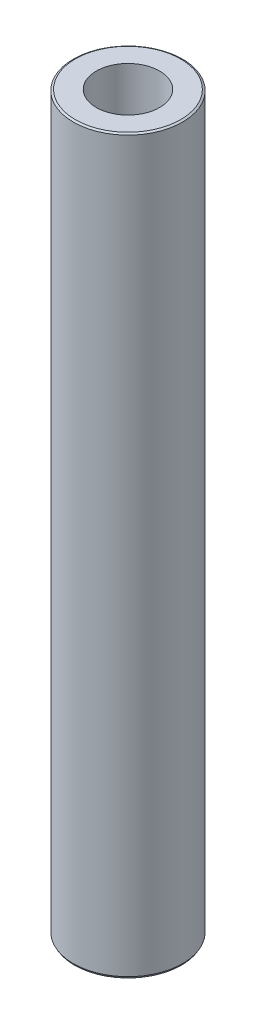
ISO-10303-21;
HEADER;
FILE_DESCRIPTION(('STEP AP214'),'2;1');
FILE_NAME('part.step','',(''),(''),'','','');
FILE_SCHEMA(('AUTOMOTIVE_DESIGN { 1 0 10303 214 1 1 1 1 }'));
ENDSEC;
DATA;
#1=APPLICATION_CONTEXT('core data for automotive mechanical design processes');
#2=APPLICATION_PROTOCOL_DEFINITION('international standard','automotive_design',2000,#1);
#3=PRODUCT_CONTEXT('',#1,'mechanical');
#4=PRODUCT('Part','Part','',(#3));
#5=PRODUCT_RELATED_PRODUCT_CATEGORY('part','',(#4));
#6=PRODUCT_DEFINITION_FORMATION('','',#4);
#7=PRODUCT_DEFINITION_CONTEXT('part definition',#1,'design');
#8=PRODUCT_DEFINITION('design','',#6,#7);
#9=PRODUCT_DEFINITION_SHAPE('','',#8);
#10=(LENGTH_UNIT() NAMED_UNIT(*) SI_UNIT(.MILLI.,.METRE.));
#11=(NAMED_UNIT(*) PLANE_ANGLE_UNIT() SI_UNIT($,.RADIAN.));
#12=(NAMED_UNIT(*) SI_UNIT($,.STERADIAN.) SOLID_ANGLE_UNIT());
#13=UNCERTAINTY_MEASURE_WITH_UNIT(LENGTH_MEASURE(1.E-05),#10,'distance_accuracy_value','');
#14=(GEOMETRIC_REPRESENTATION_CONTEXT(3) GLOBAL_UNCERTAINTY_ASSIGNED_CONTEXT((#13)) GLOBAL_UNIT_ASSIGNED_CONTEXT((#10,
#11,#12)) REPRESENTATION_CONTEXT('',''));
#15=CARTESIAN_POINT('',(0.,0.,0.));
#16=DIRECTION('',(0.,0.,1.));
#17=DIRECTION('',(1.,0.,0.));
#18=AXIS2_PLACEMENT_3D('',#15,#16,#17);
#19=CARTESIAN_POINT('',(0.,536.200548136145,0.));
#20=DIRECTION('',(0.,-1.,0.));
#21=DIRECTION('',(0.,0.,-1.));
#22=AXIS2_PLACEMENT_3D('',#19,#20,#21);
#23=CYLINDRICAL_SURFACE('',#22,40.);
#24=CARTESIAN_POINT('',(0.,535.374109914843,0.));
#25=DIRECTION('',(0.,1.,0.));
#26=DIRECTION('',(0.,0.,1.));
#27=AXIS2_PLACEMENT_3D('',#24,#25,#26);
#28=CIRCLE('',#27,40.);
#29=CARTESIAN_POINT('',(0.,535.374109914843,40.));
#30=VERTEX_POINT('',#29);
#31=EDGE_CURVE('E50',#30,#30,#28,.F.);
#32=ORIENTED_EDGE('',*,*,#31,.T.);
#33=EDGE_LOOP('',(#32));
#34=FACE_BOUND('',#33,.T.);
#35=CARTESIAN_POINT('',(0.,1.43143298861281,0.));
#36=DIRECTION('',(0.,1.,0.));
#37=DIRECTION('',(0.,0.,1.));
#38=AXIS2_PLACEMENT_3D('',#35,#36,#37);
#39=CIRCLE('',#38,40.);
#40=CARTESIAN_POINT('',(0.,1.43143298861281,40.));
#41=VERTEX_POINT('',#40);
#42=EDGE_CURVE('E51',#41,#41,#39,.T.);
#43=ORIENTED_EDGE('',*,*,#42,.T.);
#44=EDGE_LOOP('',(#43));
#45=FACE_BOUND('',#44,.T.);
#46=ADVANCED_FACE('F39',(#34,#45),#23,.T.);
#47=CARTESIAN_POINT('',(0.,536.200548136145,0.));
#48=DIRECTION('',(0.,1.,0.));
#49=DIRECTION('',(0.,0.,1.));
#50=AXIS2_PLACEMENT_3D('',#47,#48,#49);
#51=PLANE('',#50);
#52=CARTESIAN_POINT('',(0.,536.200548136145,0.));
#53=DIRECTION('',(0.,1.,0.));
#54=DIRECTION('',(0.,0.,1.));
#55=AXIS2_PLACEMENT_3D('',#52,#53,#54);
#56=CIRCLE('',#55,38.5685670113868);
#57=CARTESIAN_POINT('',(0.,536.200548136145,38.5685670113868));
#58=VERTEX_POINT('',#57);
#59=EDGE_CURVE('E54',#58,#58,#56,.T.);
#60=ORIENTED_EDGE('',*,*,#59,.T.);
#61=EDGE_LOOP('',(#60));
#62=FACE_BOUND('',#61,.T.);
#63=CARTESIAN_POINT('',(0.,536.200548136145,0.));
#64=DIRECTION('',(0.,1.,0.));
#65=DIRECTION('',(0.,0.,1.));
#66=AXIS2_PLACEMENT_3D('',#63,#64,#65);
#67=CIRCLE('',#66,23.1924539497705);
#68=CARTESIAN_POINT('',(0.,536.200548136145,23.1924539497705));
#69=VERTEX_POINT('',#68);
#70=EDGE_CURVE('E58',#69,#69,#67,.T.);
#71=ORIENTED_EDGE('',*,*,#70,.F.);
#72=EDGE_LOOP('',(#71));
#73=FACE_BOUND('',#72,.T.);
#74=ADVANCED_FACE('F69',(#62,#73),#51,.T.);
#75=CARTESIAN_POINT('',(0.,0.,0.));
#76=DIRECTION('',(0.,1.,0.));
#77=DIRECTION('',(0.,0.,1.));
#78=AXIS2_PLACEMENT_3D('',#75,#76,#77);
#79=PLANE('',#78);
#80=CARTESIAN_POINT('',(0.,0.,0.));
#81=DIRECTION('',(0.,1.,0.));
#82=DIRECTION('',(0.,0.,1.));
#83=AXIS2_PLACEMENT_3D('',#80,#81,#82);
#84=CIRCLE('',#83,39.1735617786975);
#85=CARTESIAN_POINT('',(0.,0.,39.1735617786975));
#86=VERTEX_POINT('',#85);
#87=EDGE_CURVE('E10',#86,#86,#84,.F.);
#88=ORIENTED_EDGE('',*,*,#87,.T.);
#89=EDGE_LOOP('',(#88));
#90=FACE_BOUND('',#89,.T.);
#91=CARTESIAN_POINT('',(0.,0.,0.));
#92=DIRECTION('',(0.,1.,0.));
#93=DIRECTION('',(0.,0.,1.));
#94=AXIS2_PLACEMENT_3D('',#91,#92,#93);
#95=CIRCLE('',#94,23.1924539497705);
#96=CARTESIAN_POINT('',(0.,0.,23.1924539497705));
#97=VERTEX_POINT('',#96);
#98=EDGE_CURVE('E63',#97,#97,#95,.T.);
#99=ORIENTED_EDGE('',*,*,#98,.T.);
#100=EDGE_LOOP('',(#99));
#101=FACE_BOUND('',#100,.T.);
#102=ADVANCED_FACE('F75',(#90,#101),#79,.F.);
#103=CARTESIAN_POINT('',(0.,536.200548136145,0.));
#104=DIRECTION('',(0.,-1.,0.));
#105=DIRECTION('',(0.,0.,-1.));
#106=AXIS2_PLACEMENT_3D('',#103,#104,#105);
#107=CYLINDRICAL_SURFACE('',#106,23.1924539497705);
#108=ORIENTED_EDGE('',*,*,#70,.T.);
#109=EDGE_LOOP('',(#108));
#110=FACE_BOUND('',#109,.T.);
#111=ORIENTED_EDGE('',*,*,#98,.F.);
#112=EDGE_LOOP('',(#111));
#113=FACE_BOUND('',#112,.T.);
#114=ADVANCED_FACE('F70',(#110,#113),#107,.F.);
#115=CARTESIAN_POINT('',(0.,536.200548136145,0.));
#116=DIRECTION('',(0.,-1.,0.));
#117=DIRECTION('',(0.,0.,-1.));
#118=AXIS2_PLACEMENT_3D('',#115,#116,#117);
#119=CONICAL_SURFACE('',#118,38.5685670113868,1.04719755119662);
#120=ORIENTED_EDGE('',*,*,#31,.F.);
#121=EDGE_LOOP('',(#120));
#122=FACE_BOUND('',#121,.T.);
#123=ORIENTED_EDGE('',*,*,#59,.F.);
#124=EDGE_LOOP('',(#123));
#125=FACE_BOUND('',#124,.T.);
#126=ADVANCED_FACE('F81',(#122,#125),#119,.T.);
#127=CARTESIAN_POINT('',(0.,1.43143298861281,0.));
#128=DIRECTION('',(0.,1.,0.));
#129=DIRECTION('',(0.,0.,1.));
#130=AXIS2_PLACEMENT_3D('',#127,#128,#129);
#131=CONICAL_SURFACE('',#130,40.,0.523598775598309);
#132=ORIENTED_EDGE('',*,*,#87,.F.);
#133=EDGE_LOOP('',(#132));
#134=FACE_BOUND('',#133,.T.);
#135=ORIENTED_EDGE('',*,*,#42,.F.);
#136=EDGE_LOOP('',(#135));
#137=FACE_BOUND('',#136,.T.);
#138=ADVANCED_FACE('F45',(#134,#137),#131,.T.);
#139=CLOSED_SHELL('',(#46,#74,#102,#114,#126,#138));
#140=MANIFOLD_SOLID_BREP('B2',#139);
#141=ADVANCED_BREP_SHAPE_REPRESENTATION('',(#18,#140),#14);
#142=SHAPE_DEFINITION_REPRESENTATION(#9,#141);
ENDSEC;
END-ISO-10303-21;
